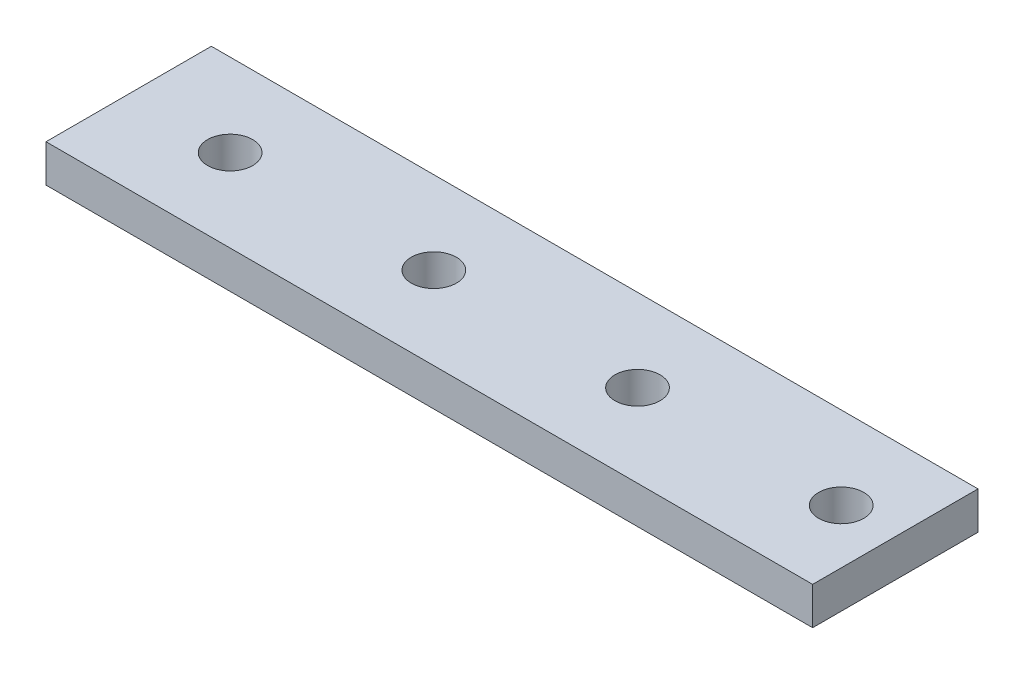
ISO-10303-21;
HEADER;
FILE_DESCRIPTION(('STEP AP214'),'2;1');
FILE_NAME('part.step','',(''),(''),'','','');
FILE_SCHEMA(('AUTOMOTIVE_DESIGN { 1 0 10303 214 1 1 1 1 }'));
ENDSEC;
DATA;
#1=APPLICATION_CONTEXT('core data for automotive mechanical design processes');
#2=APPLICATION_PROTOCOL_DEFINITION('international standard','automotive_design',2000,#1);
#3=PRODUCT_CONTEXT('',#1,'mechanical');
#4=PRODUCT('Part','Part','',(#3));
#5=PRODUCT_RELATED_PRODUCT_CATEGORY('part','',(#4));
#6=PRODUCT_DEFINITION_FORMATION('','',#4);
#7=PRODUCT_DEFINITION_CONTEXT('part definition',#1,'design');
#8=PRODUCT_DEFINITION('design','',#6,#7);
#9=PRODUCT_DEFINITION_SHAPE('','',#8);
#10=(LENGTH_UNIT() NAMED_UNIT(*) SI_UNIT(.MILLI.,.METRE.));
#11=(NAMED_UNIT(*) PLANE_ANGLE_UNIT() SI_UNIT($,.RADIAN.));
#12=(NAMED_UNIT(*) SI_UNIT($,.STERADIAN.) SOLID_ANGLE_UNIT());
#13=UNCERTAINTY_MEASURE_WITH_UNIT(LENGTH_MEASURE(1.E-05),#10,'distance_accuracy_value','');
#14=(GEOMETRIC_REPRESENTATION_CONTEXT(3) GLOBAL_UNCERTAINTY_ASSIGNED_CONTEXT((#13)) GLOBAL_UNIT_ASSIGNED_CONTEXT((#10,
#11,#12)) REPRESENTATION_CONTEXT('',''));
#15=CARTESIAN_POINT('',(0.,0.,0.));
#16=DIRECTION('',(0.,0.,1.));
#17=DIRECTION('',(1.,0.,0.));
#18=AXIS2_PLACEMENT_3D('',#15,#16,#17);
#19=CARTESIAN_POINT('',(0.,5.,0.));
#20=DIRECTION('',(0.,-1.,0.));
#21=DIRECTION('',(0.,0.,-1.));
#22=AXIS2_PLACEMENT_3D('',#19,#20,#21);
#23=PLANE('',#22);
#24=DIRECTION('',(0.,0.,-1.));
#25=VECTOR('',#24,1.);
#26=CARTESIAN_POINT('',(51.,5.,11.));
#27=LINE('',#26,#25);
#28=CARTESIAN_POINT('',(51.,5.,11.));
#29=VERTEX_POINT('',#28);
#30=CARTESIAN_POINT('',(51.,5.,-11.));
#31=VERTEX_POINT('',#30);
#32=EDGE_CURVE('E88',#29,#31,#27,.T.);
#33=ORIENTED_EDGE('',*,*,#32,.T.);
#34=DIRECTION('',(-1.,0.,0.));
#35=VECTOR('',#34,1.);
#36=CARTESIAN_POINT('',(-51.,5.,-11.));
#37=LINE('',#36,#35);
#38=CARTESIAN_POINT('',(-51.,5.,-11.));
#39=VERTEX_POINT('',#38);
#40=EDGE_CURVE('E83',#31,#39,#37,.T.);
#41=ORIENTED_EDGE('',*,*,#40,.T.);
#42=DIRECTION('',(0.,0.,1.));
#43=VECTOR('',#42,1.);
#44=CARTESIAN_POINT('',(-51.,5.,11.));
#45=LINE('',#44,#43);
#46=CARTESIAN_POINT('',(-51.,5.,11.));
#47=VERTEX_POINT('',#46);
#48=EDGE_CURVE('E86',#39,#47,#45,.T.);
#49=ORIENTED_EDGE('',*,*,#48,.T.);
#50=DIRECTION('',(1.,0.,0.));
#51=VECTOR('',#50,1.);
#52=CARTESIAN_POINT('',(-51.,5.,11.));
#53=LINE('',#52,#51);
#54=EDGE_CURVE('E53',#47,#29,#53,.T.);
#55=ORIENTED_EDGE('',*,*,#54,.T.);
#56=EDGE_LOOP('',(#33,#41,#49,#55));
#57=FACE_BOUND('',#56,.T.);
#58=CARTESIAN_POINT('',(-37.5,5.,0.));
#59=DIRECTION('',(0.,1.,0.));
#60=DIRECTION('',(0.,0.,1.));
#61=AXIS2_PLACEMENT_3D('',#58,#59,#60);
#62=CIRCLE('',#61,3.);
#63=CARTESIAN_POINT('',(-37.5,5.,3.));
#64=VERTEX_POINT('',#63);
#65=EDGE_CURVE('E103',#64,#64,#62,.T.);
#66=ORIENTED_EDGE('',*,*,#65,.F.);
#67=EDGE_LOOP('',(#66));
#68=FACE_BOUND('',#67,.T.);
#69=CARTESIAN_POINT('',(-10.4,5.,0.));
#70=DIRECTION('',(0.,1.,0.));
#71=DIRECTION('',(0.,0.,1.));
#72=AXIS2_PLACEMENT_3D('',#69,#70,#71);
#73=CIRCLE('',#72,3.);
#74=CARTESIAN_POINT('',(-10.4,5.,3.));
#75=VERTEX_POINT('',#74);
#76=EDGE_CURVE('E118',#75,#75,#73,.T.);
#77=ORIENTED_EDGE('',*,*,#76,.F.);
#78=EDGE_LOOP('',(#77));
#79=FACE_BOUND('',#78,.T.);
#80=CARTESIAN_POINT('',(16.7,5.,0.));
#81=DIRECTION('',(0.,1.,0.));
#82=DIRECTION('',(0.,0.,1.));
#83=AXIS2_PLACEMENT_3D('',#80,#81,#82);
#84=CIRCLE('',#83,3.);
#85=CARTESIAN_POINT('',(16.7,5.,3.));
#86=VERTEX_POINT('',#85);
#87=EDGE_CURVE('E124',#86,#86,#84,.T.);
#88=ORIENTED_EDGE('',*,*,#87,.F.);
#89=EDGE_LOOP('',(#88));
#90=FACE_BOUND('',#89,.T.);
#91=CARTESIAN_POINT('',(43.8,5.,0.));
#92=DIRECTION('',(0.,1.,0.));
#93=DIRECTION('',(0.,0.,1.));
#94=AXIS2_PLACEMENT_3D('',#91,#92,#93);
#95=CIRCLE('',#94,3.);
#96=CARTESIAN_POINT('',(43.8,5.,3.));
#97=VERTEX_POINT('',#96);
#98=EDGE_CURVE('E130',#97,#97,#95,.T.);
#99=ORIENTED_EDGE('',*,*,#98,.F.);
#100=EDGE_LOOP('',(#99));
#101=FACE_BOUND('',#100,.T.);
#102=ADVANCED_FACE('F36',(#57,#68,#79,#90,#101),#23,.F.);
#103=CARTESIAN_POINT('',(0.,0.,0.));
#104=DIRECTION('',(0.,-1.,0.));
#105=DIRECTION('',(0.,0.,-1.));
#106=AXIS2_PLACEMENT_3D('',#103,#104,#105);
#107=PLANE('',#106);
#108=CARTESIAN_POINT('',(16.7,0.,0.));
#109=DIRECTION('',(0.,1.,0.));
#110=DIRECTION('',(0.,0.,1.));
#111=AXIS2_PLACEMENT_3D('',#108,#109,#110);
#112=CIRCLE('',#111,3.);
#113=CARTESIAN_POINT('',(16.7,0.,3.));
#114=VERTEX_POINT('',#113);
#115=EDGE_CURVE('E127',#114,#114,#112,.T.);
#116=ORIENTED_EDGE('',*,*,#115,.T.);
#117=EDGE_LOOP('',(#116));
#118=FACE_BOUND('',#117,.T.);
#119=CARTESIAN_POINT('',(-37.5,0.,0.));
#120=DIRECTION('',(0.,1.,0.));
#121=DIRECTION('',(0.,0.,1.));
#122=AXIS2_PLACEMENT_3D('',#119,#120,#121);
#123=CIRCLE('',#122,3.);
#124=CARTESIAN_POINT('',(-37.5,0.,3.));
#125=VERTEX_POINT('',#124);
#126=EDGE_CURVE('E115',#125,#125,#123,.T.);
#127=ORIENTED_EDGE('',*,*,#126,.T.);
#128=EDGE_LOOP('',(#127));
#129=FACE_BOUND('',#128,.T.);
#130=DIRECTION('',(0.,0.,-1.));
#131=VECTOR('',#130,1.);
#132=CARTESIAN_POINT('',(51.,0.,11.));
#133=LINE('',#132,#131);
#134=CARTESIAN_POINT('',(51.,0.,11.));
#135=VERTEX_POINT('',#134);
#136=CARTESIAN_POINT('',(51.,0.,-11.));
#137=VERTEX_POINT('',#136);
#138=EDGE_CURVE('E100',#135,#137,#133,.T.);
#139=ORIENTED_EDGE('',*,*,#138,.F.);
#140=DIRECTION('',(1.,0.,0.));
#141=VECTOR('',#140,1.);
#142=CARTESIAN_POINT('',(-51.,0.,11.));
#143=LINE('',#142,#141);
#144=CARTESIAN_POINT('',(-51.,0.,11.));
#145=VERTEX_POINT('',#144);
#146=EDGE_CURVE('E76',#145,#135,#143,.T.);
#147=ORIENTED_EDGE('',*,*,#146,.F.);
#148=DIRECTION('',(0.,0.,1.));
#149=VECTOR('',#148,1.);
#150=CARTESIAN_POINT('',(-51.,0.,11.));
#151=LINE('',#150,#149);
#152=CARTESIAN_POINT('',(-51.,0.,-11.));
#153=VERTEX_POINT('',#152);
#154=EDGE_CURVE('E70',#153,#145,#151,.T.);
#155=ORIENTED_EDGE('',*,*,#154,.F.);
#156=DIRECTION('',(-1.,0.,0.));
#157=VECTOR('',#156,1.);
#158=CARTESIAN_POINT('',(-51.,0.,-11.));
#159=LINE('',#158,#157);
#160=EDGE_CURVE('E92',#137,#153,#159,.T.);
#161=ORIENTED_EDGE('',*,*,#160,.F.);
#162=EDGE_LOOP('',(#139,#147,#155,#161));
#163=FACE_BOUND('',#162,.T.);
#164=CARTESIAN_POINT('',(-10.4,0.,0.));
#165=DIRECTION('',(0.,1.,0.));
#166=DIRECTION('',(0.,0.,1.));
#167=AXIS2_PLACEMENT_3D('',#164,#165,#166);
#168=CIRCLE('',#167,3.);
#169=CARTESIAN_POINT('',(-10.4,0.,3.));
#170=VERTEX_POINT('',#169);
#171=EDGE_CURVE('E121',#170,#170,#168,.T.);
#172=ORIENTED_EDGE('',*,*,#171,.T.);
#173=EDGE_LOOP('',(#172));
#174=FACE_BOUND('',#173,.T.);
#175=CARTESIAN_POINT('',(43.8,0.,0.));
#176=DIRECTION('',(0.,1.,0.));
#177=DIRECTION('',(0.,0.,1.));
#178=AXIS2_PLACEMENT_3D('',#175,#176,#177);
#179=CIRCLE('',#178,3.);
#180=CARTESIAN_POINT('',(43.8,0.,3.));
#181=VERTEX_POINT('',#180);
#182=EDGE_CURVE('E133',#181,#181,#179,.T.);
#183=ORIENTED_EDGE('',*,*,#182,.T.);
#184=EDGE_LOOP('',(#183));
#185=FACE_BOUND('',#184,.T.);
#186=ADVANCED_FACE('F111',(#118,#129,#163,#174,#185),#107,.T.);
#187=CARTESIAN_POINT('',(51.,5.,11.));
#188=DIRECTION('',(-1.,0.,0.));
#189=DIRECTION('',(0.,0.,1.));
#190=AXIS2_PLACEMENT_3D('',#187,#188,#189);
#191=PLANE('',#190);
#192=ORIENTED_EDGE('',*,*,#138,.T.);
#193=DIRECTION('',(0.,-1.,0.));
#194=VECTOR('',#193,1.);
#195=CARTESIAN_POINT('',(51.,5.,-11.));
#196=LINE('',#195,#194);
#197=EDGE_CURVE('E11',#31,#137,#196,.T.);
#198=ORIENTED_EDGE('',*,*,#197,.F.);
#199=ORIENTED_EDGE('',*,*,#32,.F.);
#200=DIRECTION('',(0.,-1.,0.));
#201=VECTOR('',#200,1.);
#202=CARTESIAN_POINT('',(51.,5.,11.));
#203=LINE('',#202,#201);
#204=EDGE_CURVE('E96',#29,#135,#203,.T.);
#205=ORIENTED_EDGE('',*,*,#204,.T.);
#206=EDGE_LOOP('',(#192,#198,#199,#205));
#207=FACE_BOUND('',#206,.T.);
#208=ADVANCED_FACE('F38',(#207),#191,.F.);
#209=CARTESIAN_POINT('',(-51.,5.,-11.));
#210=DIRECTION('',(0.,0.,1.));
#211=DIRECTION('',(1.,0.,0.));
#212=AXIS2_PLACEMENT_3D('',#209,#210,#211);
#213=PLANE('',#212);
#214=ORIENTED_EDGE('',*,*,#160,.T.);
#215=DIRECTION('',(0.,-1.,0.));
#216=VECTOR('',#215,1.);
#217=CARTESIAN_POINT('',(-51.,5.,-11.));
#218=LINE('',#217,#216);
#219=EDGE_CURVE('E45',#39,#153,#218,.T.);
#220=ORIENTED_EDGE('',*,*,#219,.F.);
#221=ORIENTED_EDGE('',*,*,#40,.F.);
#222=ORIENTED_EDGE('',*,*,#197,.T.);
#223=EDGE_LOOP('',(#214,#220,#221,#222));
#224=FACE_BOUND('',#223,.T.);
#225=ADVANCED_FACE('F91',(#224),#213,.F.);
#226=CARTESIAN_POINT('',(-51.,5.,11.));
#227=DIRECTION('',(1.,0.,0.));
#228=DIRECTION('',(0.,0.,-1.));
#229=AXIS2_PLACEMENT_3D('',#226,#227,#228);
#230=PLANE('',#229);
#231=ORIENTED_EDGE('',*,*,#154,.T.);
#232=DIRECTION('',(0.,-1.,0.));
#233=VECTOR('',#232,1.);
#234=CARTESIAN_POINT('',(-51.,5.,11.));
#235=LINE('',#234,#233);
#236=EDGE_CURVE('E93',#47,#145,#235,.T.);
#237=ORIENTED_EDGE('',*,*,#236,.F.);
#238=ORIENTED_EDGE('',*,*,#48,.F.);
#239=ORIENTED_EDGE('',*,*,#219,.T.);
#240=EDGE_LOOP('',(#231,#237,#238,#239));
#241=FACE_BOUND('',#240,.T.);
#242=ADVANCED_FACE('F94',(#241),#230,.F.);
#243=CARTESIAN_POINT('',(-51.,5.,11.));
#244=DIRECTION('',(0.,0.,-1.));
#245=DIRECTION('',(-1.,0.,0.));
#246=AXIS2_PLACEMENT_3D('',#243,#244,#245);
#247=PLANE('',#246);
#248=ORIENTED_EDGE('',*,*,#146,.T.);
#249=ORIENTED_EDGE('',*,*,#204,.F.);
#250=ORIENTED_EDGE('',*,*,#54,.F.);
#251=ORIENTED_EDGE('',*,*,#236,.T.);
#252=EDGE_LOOP('',(#248,#249,#250,#251));
#253=FACE_BOUND('',#252,.T.);
#254=ADVANCED_FACE('F108',(#253),#247,.F.);
#255=CARTESIAN_POINT('',(-37.5,5.,0.));
#256=DIRECTION('',(0.,-1.,0.));
#257=DIRECTION('',(0.,0.,-1.));
#258=AXIS2_PLACEMENT_3D('',#255,#256,#257);
#259=CYLINDRICAL_SURFACE('',#258,3.);
#260=ORIENTED_EDGE('',*,*,#65,.T.);
#261=EDGE_LOOP('',(#260));
#262=FACE_BOUND('',#261,.T.);
#263=ORIENTED_EDGE('',*,*,#126,.F.);
#264=EDGE_LOOP('',(#263));
#265=FACE_BOUND('',#264,.T.);
#266=ADVANCED_FACE('F150',(#262,#265),#259,.F.);
#267=CARTESIAN_POINT('',(-10.4,5.,0.));
#268=DIRECTION('',(0.,-1.,0.));
#269=DIRECTION('',(0.,0.,-1.));
#270=AXIS2_PLACEMENT_3D('',#267,#268,#269);
#271=CYLINDRICAL_SURFACE('',#270,3.);
#272=ORIENTED_EDGE('',*,*,#76,.T.);
#273=EDGE_LOOP('',(#272));
#274=FACE_BOUND('',#273,.T.);
#275=ORIENTED_EDGE('',*,*,#171,.F.);
#276=EDGE_LOOP('',(#275));
#277=FACE_BOUND('',#276,.T.);
#278=ADVANCED_FACE('F204',(#274,#277),#271,.F.);
#279=CARTESIAN_POINT('',(16.7,5.,0.));
#280=DIRECTION('',(0.,-1.,0.));
#281=DIRECTION('',(0.,0.,-1.));
#282=AXIS2_PLACEMENT_3D('',#279,#280,#281);
#283=CYLINDRICAL_SURFACE('',#282,3.);
#284=ORIENTED_EDGE('',*,*,#87,.T.);
#285=EDGE_LOOP('',(#284));
#286=FACE_BOUND('',#285,.T.);
#287=ORIENTED_EDGE('',*,*,#115,.F.);
#288=EDGE_LOOP('',(#287));
#289=FACE_BOUND('',#288,.T.);
#290=ADVANCED_FACE('F213',(#286,#289),#283,.F.);
#291=CARTESIAN_POINT('',(43.8,5.,0.));
#292=DIRECTION('',(0.,-1.,0.));
#293=DIRECTION('',(0.,0.,-1.));
#294=AXIS2_PLACEMENT_3D('',#291,#292,#293);
#295=CYLINDRICAL_SURFACE('',#294,3.);
#296=ORIENTED_EDGE('',*,*,#98,.T.);
#297=EDGE_LOOP('',(#296));
#298=FACE_BOUND('',#297,.T.);
#299=ORIENTED_EDGE('',*,*,#182,.F.);
#300=EDGE_LOOP('',(#299));
#301=FACE_BOUND('',#300,.T.);
#302=ADVANCED_FACE('F139',(#298,#301),#295,.F.);
#303=CLOSED_SHELL('',(#102,#186,#208,#225,#242,#254,#266,#278,#290,#302));
#304=MANIFOLD_SOLID_BREP('B2',#303);
#305=ADVANCED_BREP_SHAPE_REPRESENTATION('',(#18,#304),#14);
#306=SHAPE_DEFINITION_REPRESENTATION(#9,#305);
ENDSEC;
END-ISO-10303-21;
